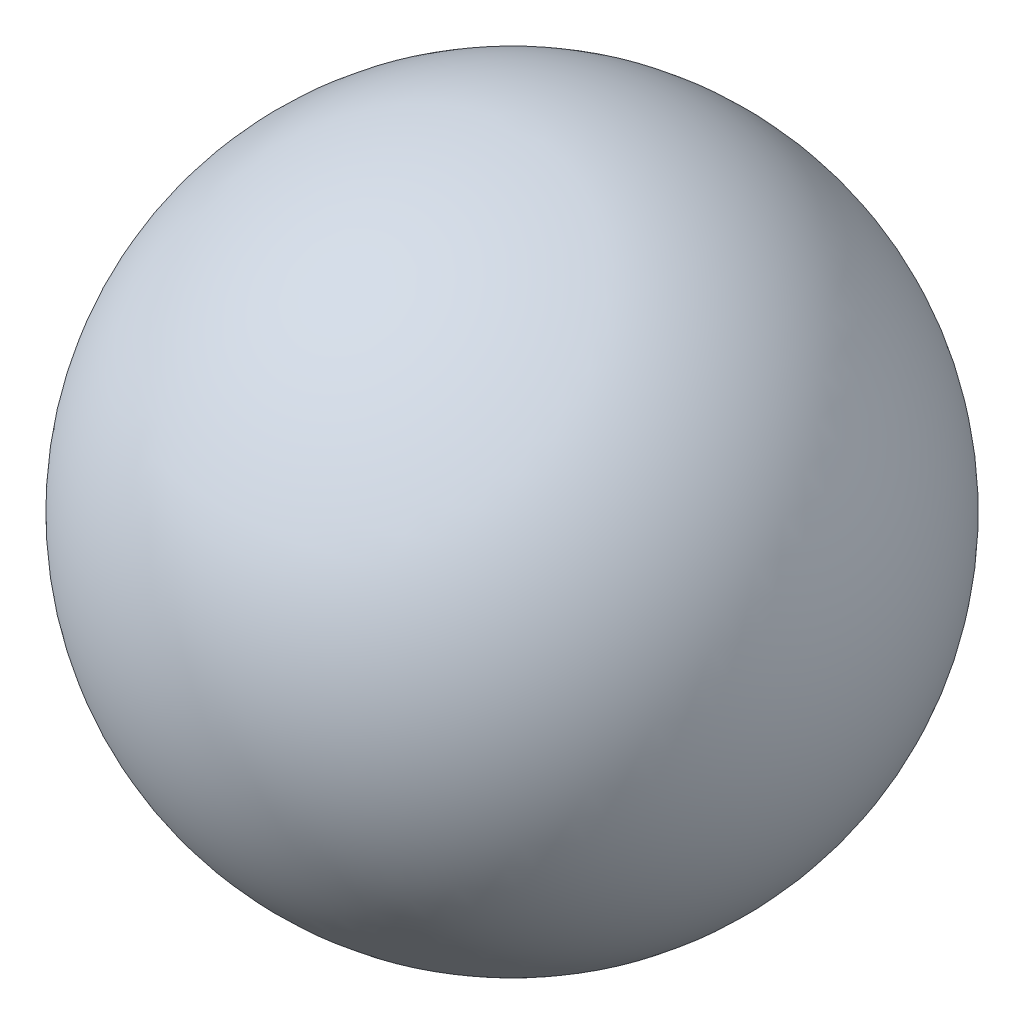
ISO-10303-21;
HEADER;
FILE_DESCRIPTION(('STEP AP214'),'2;1');
FILE_NAME('part.step','',(''),(''),'','','');
FILE_SCHEMA(('AUTOMOTIVE_DESIGN { 1 0 10303 214 1 1 1 1 }'));
ENDSEC;
DATA;
#1=APPLICATION_CONTEXT('core data for automotive mechanical design processes');
#2=APPLICATION_PROTOCOL_DEFINITION('international standard','automotive_design',2000,#1);
#3=PRODUCT_CONTEXT('',#1,'mechanical');
#4=PRODUCT('Part','Part','',(#3));
#5=PRODUCT_RELATED_PRODUCT_CATEGORY('part','',(#4));
#6=PRODUCT_DEFINITION_FORMATION('','',#4);
#7=PRODUCT_DEFINITION_CONTEXT('part definition',#1,'design');
#8=PRODUCT_DEFINITION('design','',#6,#7);
#9=PRODUCT_DEFINITION_SHAPE('','',#8);
#10=(LENGTH_UNIT() NAMED_UNIT(*) SI_UNIT(.MILLI.,.METRE.));
#11=(NAMED_UNIT(*) PLANE_ANGLE_UNIT() SI_UNIT($,.RADIAN.));
#12=(NAMED_UNIT(*) SI_UNIT($,.STERADIAN.) SOLID_ANGLE_UNIT());
#13=UNCERTAINTY_MEASURE_WITH_UNIT(LENGTH_MEASURE(1.E-05),#10,'distance_accuracy_value','');
#14=(GEOMETRIC_REPRESENTATION_CONTEXT(3) GLOBAL_UNCERTAINTY_ASSIGNED_CONTEXT((#13)) GLOBAL_UNIT_ASSIGNED_CONTEXT((#10,
#11,#12)) REPRESENTATION_CONTEXT('',''));
#15=CARTESIAN_POINT('',(0.,0.,0.));
#16=DIRECTION('',(0.,0.,1.));
#17=DIRECTION('',(1.,0.,0.));
#18=AXIS2_PLACEMENT_3D('',#15,#16,#17);
#19=CARTESIAN_POINT('',(3.175,0.,0.));
#20=DIRECTION('',(0.,-1.,0.));
#21=DIRECTION('',(0.,0.,1.));
#22=AXIS2_PLACEMENT_3D('',#19,#20,#21);
#23=SPHERICAL_SURFACE('',#22,0.794);
#24=CARTESIAN_POINT('',(3.175,-0.794,0.));
#25=VERTEX_POINT('',#24);
#26=VERTEX_LOOP('',#25);
#27=FACE_BOUND('',#26,.T.);
#28=ADVANCED_FACE('F12',(#27),#23,.T.);
#29=CLOSED_SHELL('',(#28));
#30=MANIFOLD_SOLID_BREP('B1',#29);
#31=ADVANCED_BREP_SHAPE_REPRESENTATION('',(#18,#30),#14);
#32=SHAPE_DEFINITION_REPRESENTATION(#9,#31);
ENDSEC;
END-ISO-10303-21;
